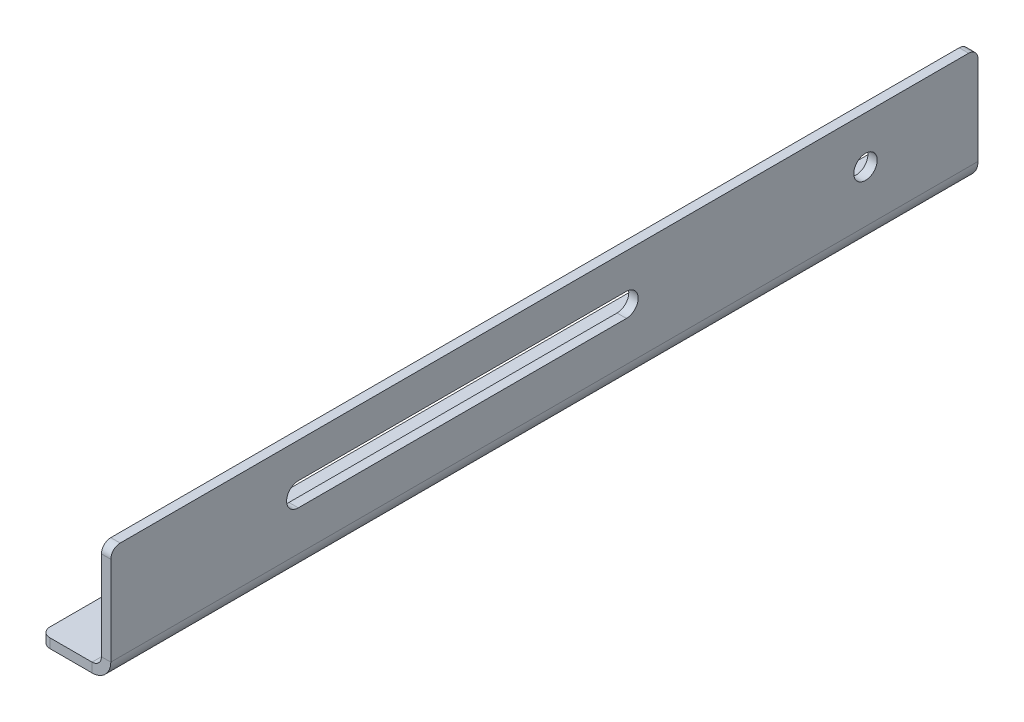
ISO-10303-21;
HEADER;
FILE_DESCRIPTION(('STEP AP214'),'2;1');
FILE_NAME('part.step','',(''),(''),'','','');
FILE_SCHEMA(('AUTOMOTIVE_DESIGN { 1 0 10303 214 1 1 1 1 }'));
ENDSEC;
DATA;
#1=APPLICATION_CONTEXT('core data for automotive mechanical design processes');
#2=APPLICATION_PROTOCOL_DEFINITION('international standard','automotive_design',2000,#1);
#3=PRODUCT_CONTEXT('',#1,'mechanical');
#4=PRODUCT('Part','Part','',(#3));
#5=PRODUCT_RELATED_PRODUCT_CATEGORY('part','',(#4));
#6=PRODUCT_DEFINITION_FORMATION('','',#4);
#7=PRODUCT_DEFINITION_CONTEXT('part definition',#1,'design');
#8=PRODUCT_DEFINITION('design','',#6,#7);
#9=PRODUCT_DEFINITION_SHAPE('','',#8);
#10=(LENGTH_UNIT() NAMED_UNIT(*) SI_UNIT(.MILLI.,.METRE.));
#11=(NAMED_UNIT(*) PLANE_ANGLE_UNIT() SI_UNIT($,.RADIAN.));
#12=(NAMED_UNIT(*) SI_UNIT($,.STERADIAN.) SOLID_ANGLE_UNIT());
#13=UNCERTAINTY_MEASURE_WITH_UNIT(LENGTH_MEASURE(1.E-05),#10,'distance_accuracy_value','');
#14=(GEOMETRIC_REPRESENTATION_CONTEXT(3) GLOBAL_UNCERTAINTY_ASSIGNED_CONTEXT((#13)) GLOBAL_UNIT_ASSIGNED_CONTEXT((#10,
#11,#12)) REPRESENTATION_CONTEXT('',''));
#15=CARTESIAN_POINT('',(0.,0.,0.));
#16=DIRECTION('',(0.,0.,1.));
#17=DIRECTION('',(1.,0.,0.));
#18=AXIS2_PLACEMENT_3D('',#15,#16,#17);
#19=CARTESIAN_POINT('',(0.,4.,0.));
#20=DIRECTION('',(0.,0.,1.));
#21=DIRECTION('',(-1.,0.,0.));
#22=AXIS2_PLACEMENT_3D('',#19,#20,#21);
#23=PLANE('',#22);
#24=DIRECTION('',(1.,0.,0.));
#25=VECTOR('',#24,1.);
#26=CARTESIAN_POINT('',(0.,0.,0.));
#27=LINE('',#26,#25);
#28=CARTESIAN_POINT('',(22.,0.,0.));
#29=VERTEX_POINT('',#28);
#30=CARTESIAN_POINT('',(4.,0.,0.));
#31=VERTEX_POINT('',#30);
#32=EDGE_CURVE('E271',#29,#31,#27,.F.);
#33=ORIENTED_EDGE('',*,*,#32,.T.);
#34=DIRECTION('',(0.,1.,0.));
#35=VECTOR('',#34,1.);
#36=CARTESIAN_POINT('',(4.,4.,0.));
#37=LINE('',#36,#35);
#38=CARTESIAN_POINT('',(4.,4.,0.));
#39=VERTEX_POINT('',#38);
#40=EDGE_CURVE('E303',#31,#39,#37,.T.);
#41=ORIENTED_EDGE('',*,*,#40,.T.);
#42=DIRECTION('',(-1.,0.,0.));
#43=VECTOR('',#42,1.);
#44=CARTESIAN_POINT('',(0.,4.,0.));
#45=LINE('',#44,#43);
#46=CARTESIAN_POINT('',(22.,4.,0.));
#47=VERTEX_POINT('',#46);
#48=EDGE_CURVE('E390',#47,#39,#45,.T.);
#49=ORIENTED_EDGE('',*,*,#48,.F.);
#50=DIRECTION('',(0.,1.,0.));
#51=VECTOR('',#50,1.);
#52=CARTESIAN_POINT('',(22.,4.,0.));
#53=LINE('',#52,#51);
#54=EDGE_CURVE('E300',#29,#47,#53,.T.);
#55=ORIENTED_EDGE('',*,*,#54,.F.);
#56=EDGE_LOOP('',(#33,#41,#49,#55));
#57=FACE_BOUND('',#56,.T.);
#58=ADVANCED_FACE('F42',(#57),#23,.F.);
#59=CARTESIAN_POINT('',(0.,4.,370.));
#60=DIRECTION('',(-1.,0.,0.));
#61=DIRECTION('',(0.,0.,-1.));
#62=AXIS2_PLACEMENT_3D('',#59,#60,#61);
#63=PLANE('',#62);
#64=DIRECTION('',(0.,0.,-1.));
#65=VECTOR('',#64,1.);
#66=CARTESIAN_POINT('',(0.,4.,370.));
#67=LINE('',#66,#65);
#68=CARTESIAN_POINT('',(0.,4.,366.));
#69=VERTEX_POINT('',#68);
#70=CARTESIAN_POINT('',(0.,4.,4.));
#71=VERTEX_POINT('',#70);
#72=EDGE_CURVE('E404',#69,#71,#67,.T.);
#73=ORIENTED_EDGE('',*,*,#72,.T.);
#74=DIRECTION('',(0.,-1.,0.));
#75=VECTOR('',#74,1.);
#76=CARTESIAN_POINT('',(0.,4.,4.));
#77=LINE('',#76,#75);
#78=CARTESIAN_POINT('',(0.,0.,4.));
#79=VERTEX_POINT('',#78);
#80=EDGE_CURVE('E320',#71,#79,#77,.T.);
#81=ORIENTED_EDGE('',*,*,#80,.T.);
#82=DIRECTION('',(0.,0.,-1.));
#83=VECTOR('',#82,1.);
#84=CARTESIAN_POINT('',(0.,0.,370.));
#85=LINE('',#84,#83);
#86=CARTESIAN_POINT('',(0.,0.,366.));
#87=VERTEX_POINT('',#86);
#88=EDGE_CURVE('E267',#87,#79,#85,.T.);
#89=ORIENTED_EDGE('',*,*,#88,.F.);
#90=DIRECTION('',(0.,1.,0.));
#91=VECTOR('',#90,1.);
#92=CARTESIAN_POINT('',(0.,4.,366.));
#93=LINE('',#92,#91);
#94=EDGE_CURVE('E316',#87,#69,#93,.T.);
#95=ORIENTED_EDGE('',*,*,#94,.T.);
#96=EDGE_LOOP('',(#73,#81,#89,#95));
#97=FACE_BOUND('',#96,.T.);
#98=ADVANCED_FACE('F450',(#97),#63,.T.);
#99=CARTESIAN_POINT('',(0.,4.,370.));
#100=DIRECTION('',(0.,0.,1.));
#101=DIRECTION('',(-1.,0.,0.));
#102=AXIS2_PLACEMENT_3D('',#99,#100,#101);
#103=PLANE('',#102);
#104=DIRECTION('',(-1.,0.,0.));
#105=VECTOR('',#104,1.);
#106=CARTESIAN_POINT('',(0.,4.,370.));
#107=LINE('',#106,#105);
#108=CARTESIAN_POINT('',(22.,4.,370.));
#109=VERTEX_POINT('',#108);
#110=CARTESIAN_POINT('',(4.,4.,370.));
#111=VERTEX_POINT('',#110);
#112=EDGE_CURVE('E410',#109,#111,#107,.T.);
#113=ORIENTED_EDGE('',*,*,#112,.T.);
#114=DIRECTION('',(0.,1.,0.));
#115=VECTOR('',#114,1.);
#116=CARTESIAN_POINT('',(4.,4.,370.));
#117=LINE('',#116,#115);
#118=CARTESIAN_POINT('',(4.,0.,370.));
#119=VERTEX_POINT('',#118);
#120=EDGE_CURVE('E11',#111,#119,#117,.F.);
#121=ORIENTED_EDGE('',*,*,#120,.T.);
#122=DIRECTION('',(1.,0.,0.));
#123=VECTOR('',#122,1.);
#124=CARTESIAN_POINT('',(0.,0.,370.));
#125=LINE('',#124,#123);
#126=CARTESIAN_POINT('',(22.,0.,370.));
#127=VERTEX_POINT('',#126);
#128=EDGE_CURVE('E235',#127,#119,#125,.F.);
#129=ORIENTED_EDGE('',*,*,#128,.F.);
#130=DIRECTION('',(0.,1.,0.));
#131=VECTOR('',#130,1.);
#132=CARTESIAN_POINT('',(22.,4.,370.));
#133=LINE('',#132,#131);
#134=EDGE_CURVE('E297',#127,#109,#133,.T.);
#135=ORIENTED_EDGE('',*,*,#134,.T.);
#136=EDGE_LOOP('',(#113,#121,#129,#135));
#137=FACE_BOUND('',#136,.T.);
#138=ADVANCED_FACE('F455',(#137),#103,.T.);
#139=CARTESIAN_POINT('',(22.,8.,370.));
#140=DIRECTION('',(0.,0.,1.));
#141=DIRECTION('',(1.,0.,0.));
#142=AXIS2_PLACEMENT_3D('',#139,#140,#141);
#143=PLANE('',#142);
#144=ORIENTED_EDGE('',*,*,#134,.F.);
#145=CARTESIAN_POINT('',(22.,8.,370.));
#146=DIRECTION('',(0.,0.,1.));
#147=DIRECTION('',(1.,0.,0.));
#148=AXIS2_PLACEMENT_3D('',#145,#146,#147);
#149=CIRCLE('',#148,8.);
#150=CARTESIAN_POINT('',(30.,8.,370.));
#151=VERTEX_POINT('',#150);
#152=EDGE_CURVE('E258',#127,#151,#149,.T.);
#153=ORIENTED_EDGE('',*,*,#152,.T.);
#154=DIRECTION('',(-1.,0.,0.));
#155=VECTOR('',#154,1.);
#156=CARTESIAN_POINT('',(26.,8.,370.));
#157=LINE('',#156,#155);
#158=CARTESIAN_POINT('',(26.,8.,370.));
#159=VERTEX_POINT('',#158);
#160=EDGE_CURVE('E293',#151,#159,#157,.T.);
#161=ORIENTED_EDGE('',*,*,#160,.T.);
#162=CARTESIAN_POINT('',(22.,8.,370.));
#163=DIRECTION('',(0.,0.,-1.));
#164=DIRECTION('',(-1.,0.,0.));
#165=AXIS2_PLACEMENT_3D('',#162,#163,#164);
#166=CIRCLE('',#165,4.);
#167=EDGE_CURVE('E217',#109,#159,#166,.F.);
#168=ORIENTED_EDGE('',*,*,#167,.F.);
#169=EDGE_LOOP('',(#144,#153,#161,#168));
#170=FACE_BOUND('',#169,.T.);
#171=ADVANCED_FACE('F366',(#170),#143,.T.);
#172=CARTESIAN_POINT('',(26.,4.,370.));
#173=DIRECTION('',(0.,0.,1.));
#174=DIRECTION('',(0.,-1.,0.));
#175=AXIS2_PLACEMENT_3D('',#172,#173,#174);
#176=PLANE('',#175);
#177=DIRECTION('',(0.,1.,0.));
#178=VECTOR('',#177,1.);
#179=CARTESIAN_POINT('',(30.,4.,370.));
#180=LINE('',#179,#178);
#181=CARTESIAN_POINT('',(30.,46.,370.));
#182=VERTEX_POINT('',#181);
#183=EDGE_CURVE('E252',#182,#151,#180,.F.);
#184=ORIENTED_EDGE('',*,*,#183,.F.);
#185=DIRECTION('',(1.,0.,0.));
#186=VECTOR('',#185,1.);
#187=CARTESIAN_POINT('',(26.,46.,370.));
#188=LINE('',#187,#186);
#189=CARTESIAN_POINT('',(26.,46.,370.));
#190=VERTEX_POINT('',#189);
#191=EDGE_CURVE('E51',#182,#190,#188,.F.);
#192=ORIENTED_EDGE('',*,*,#191,.T.);
#193=DIRECTION('',(0.,-1.,0.));
#194=VECTOR('',#193,1.);
#195=CARTESIAN_POINT('',(26.,4.,370.));
#196=LINE('',#195,#194);
#197=EDGE_CURVE('E199',#190,#159,#196,.T.);
#198=ORIENTED_EDGE('',*,*,#197,.T.);
#199=ORIENTED_EDGE('',*,*,#160,.F.);
#200=EDGE_LOOP('',(#184,#192,#198,#199));
#201=FACE_BOUND('',#200,.T.);
#202=ADVANCED_FACE('F354',(#201),#176,.T.);
#203=CARTESIAN_POINT('',(26.,50.,370.));
#204=DIRECTION('',(0.,-1.,0.));
#205=DIRECTION('',(0.,0.,-1.));
#206=AXIS2_PLACEMENT_3D('',#203,#204,#205);
#207=PLANE('',#206);
#208=DIRECTION('',(0.,0.,-1.));
#209=VECTOR('',#208,1.);
#210=CARTESIAN_POINT('',(30.,50.,370.));
#211=LINE('',#210,#209);
#212=CARTESIAN_POINT('',(30.,50.,366.));
#213=VERTEX_POINT('',#212);
#214=CARTESIAN_POINT('',(30.,50.,4.));
#215=VERTEX_POINT('',#214);
#216=EDGE_CURVE('E230',#213,#215,#211,.T.);
#217=ORIENTED_EDGE('',*,*,#216,.T.);
#218=DIRECTION('',(1.,0.,0.));
#219=VECTOR('',#218,1.);
#220=CARTESIAN_POINT('',(26.,50.,4.));
#221=LINE('',#220,#219);
#222=CARTESIAN_POINT('',(26.,50.,4.));
#223=VERTEX_POINT('',#222);
#224=EDGE_CURVE('E332',#215,#223,#221,.F.);
#225=ORIENTED_EDGE('',*,*,#224,.T.);
#226=DIRECTION('',(0.,0.,-1.));
#227=VECTOR('',#226,1.);
#228=CARTESIAN_POINT('',(26.,50.,370.));
#229=LINE('',#228,#227);
#230=CARTESIAN_POINT('',(26.,50.,366.));
#231=VERTEX_POINT('',#230);
#232=EDGE_CURVE('E202',#231,#223,#229,.T.);
#233=ORIENTED_EDGE('',*,*,#232,.F.);
#234=DIRECTION('',(-1.,0.,0.));
#235=VECTOR('',#234,1.);
#236=CARTESIAN_POINT('',(26.,50.,366.));
#237=LINE('',#236,#235);
#238=EDGE_CURVE('E329',#231,#213,#237,.F.);
#239=ORIENTED_EDGE('',*,*,#238,.T.);
#240=EDGE_LOOP('',(#217,#225,#233,#239));
#241=FACE_BOUND('',#240,.T.);
#242=ADVANCED_FACE('F381',(#241),#207,.F.);
#243=CARTESIAN_POINT('',(26.,4.,0.));
#244=DIRECTION('',(0.,0.,1.));
#245=DIRECTION('',(0.,-1.,0.));
#246=AXIS2_PLACEMENT_3D('',#243,#244,#245);
#247=PLANE('',#246);
#248=DIRECTION('',(0.,-1.,0.));
#249=VECTOR('',#248,1.);
#250=CARTESIAN_POINT('',(26.,4.,0.));
#251=LINE('',#250,#249);
#252=CARTESIAN_POINT('',(26.,46.,0.));
#253=VERTEX_POINT('',#252);
#254=CARTESIAN_POINT('',(26.,8.,0.));
#255=VERTEX_POINT('',#254);
#256=EDGE_CURVE('E196',#253,#255,#251,.T.);
#257=ORIENTED_EDGE('',*,*,#256,.F.);
#258=DIRECTION('',(1.,0.,0.));
#259=VECTOR('',#258,1.);
#260=CARTESIAN_POINT('',(26.,46.,0.));
#261=LINE('',#260,#259);
#262=CARTESIAN_POINT('',(30.,46.,0.));
#263=VERTEX_POINT('',#262);
#264=EDGE_CURVE('E66',#253,#263,#261,.T.);
#265=ORIENTED_EDGE('',*,*,#264,.T.);
#266=DIRECTION('',(0.,1.,0.));
#267=VECTOR('',#266,1.);
#268=CARTESIAN_POINT('',(30.,4.,0.));
#269=LINE('',#268,#267);
#270=CARTESIAN_POINT('',(30.,8.,0.));
#271=VERTEX_POINT('',#270);
#272=EDGE_CURVE('E243',#263,#271,#269,.F.);
#273=ORIENTED_EDGE('',*,*,#272,.T.);
#274=DIRECTION('',(-1.,0.,0.));
#275=VECTOR('',#274,1.);
#276=CARTESIAN_POINT('',(26.,8.,0.));
#277=LINE('',#276,#275);
#278=EDGE_CURVE('E291',#271,#255,#277,.T.);
#279=ORIENTED_EDGE('',*,*,#278,.T.);
#280=EDGE_LOOP('',(#257,#265,#273,#279));
#281=FACE_BOUND('',#280,.T.);
#282=ADVANCED_FACE('F383',(#281),#247,.F.);
#283=CARTESIAN_POINT('',(26.,35.,150.));
#284=DIRECTION('',(0.,-1.,0.));
#285=DIRECTION('',(0.,0.,-1.));
#286=AXIS2_PLACEMENT_3D('',#283,#284,#285);
#287=PLANE('',#286);
#288=DIRECTION('',(-1.,0.,0.));
#289=VECTOR('',#288,1.);
#290=CARTESIAN_POINT('',(26.,35.,150.));
#291=LINE('',#290,#289);
#292=CARTESIAN_POINT('',(30.,35.,150.));
#293=VERTEX_POINT('',#292);
#294=CARTESIAN_POINT('',(26.,35.,150.));
#295=VERTEX_POINT('',#294);
#296=EDGE_CURVE('E185',#293,#295,#291,.T.);
#297=ORIENTED_EDGE('',*,*,#296,.F.);
#298=DIRECTION('',(0.,0.,-1.));
#299=VECTOR('',#298,1.);
#300=CARTESIAN_POINT('',(30.,35.,370.));
#301=LINE('',#300,#299);
#302=CARTESIAN_POINT('',(30.,35.,290.));
#303=VERTEX_POINT('',#302);
#304=EDGE_CURVE('E244',#303,#293,#301,.T.);
#305=ORIENTED_EDGE('',*,*,#304,.F.);
#306=DIRECTION('',(-1.,0.,0.));
#307=VECTOR('',#306,1.);
#308=CARTESIAN_POINT('',(26.,35.,290.));
#309=LINE('',#308,#307);
#310=CARTESIAN_POINT('',(26.,35.,290.));
#311=VERTEX_POINT('',#310);
#312=EDGE_CURVE('E287',#303,#311,#309,.T.);
#313=ORIENTED_EDGE('',*,*,#312,.T.);
#314=DIRECTION('',(0.,0.,-1.));
#315=VECTOR('',#314,1.);
#316=CARTESIAN_POINT('',(26.,35.,150.));
#317=LINE('',#316,#315);
#318=EDGE_CURVE('E187',#311,#295,#317,.T.);
#319=ORIENTED_EDGE('',*,*,#318,.T.);
#320=EDGE_LOOP('',(#297,#305,#313,#319));
#321=FACE_BOUND('',#320,.T.);
#322=ADVANCED_FACE('F439',(#321),#287,.T.);
#323=CARTESIAN_POINT('',(26.,30.,290.));
#324=DIRECTION('',(1.,0.,0.));
#325=DIRECTION('',(0.,0.,-1.));
#326=AXIS2_PLACEMENT_3D('',#323,#324,#325);
#327=CYLINDRICAL_SURFACE('',#326,5.);
#328=ORIENTED_EDGE('',*,*,#312,.F.);
#329=CARTESIAN_POINT('',(30.,30.,290.));
#330=DIRECTION('',(-1.,0.,0.));
#331=DIRECTION('',(0.,-1.,0.));
#332=AXIS2_PLACEMENT_3D('',#329,#330,#331);
#333=CIRCLE('',#332,5.);
#334=CARTESIAN_POINT('',(30.,25.,290.));
#335=VERTEX_POINT('',#334);
#336=EDGE_CURVE('E239',#335,#303,#333,.T.);
#337=ORIENTED_EDGE('',*,*,#336,.F.);
#338=DIRECTION('',(-1.,0.,0.));
#339=VECTOR('',#338,1.);
#340=CARTESIAN_POINT('',(26.,25.,290.));
#341=LINE('',#340,#339);
#342=CARTESIAN_POINT('',(26.,25.,290.));
#343=VERTEX_POINT('',#342);
#344=EDGE_CURVE('E169',#335,#343,#341,.T.);
#345=ORIENTED_EDGE('',*,*,#344,.T.);
#346=CARTESIAN_POINT('',(26.,30.,290.));
#347=DIRECTION('',(-1.,0.,0.));
#348=DIRECTION('',(0.,-1.,0.));
#349=AXIS2_PLACEMENT_3D('',#346,#347,#348);
#350=CIRCLE('',#349,5.);
#351=EDGE_CURVE('E180',#343,#311,#350,.T.);
#352=ORIENTED_EDGE('',*,*,#351,.T.);
#353=EDGE_LOOP('',(#328,#337,#345,#352));
#354=FACE_BOUND('',#353,.T.);
#355=ADVANCED_FACE('F436',(#354),#327,.F.);
#356=CARTESIAN_POINT('',(26.,25.,150.));
#357=DIRECTION('',(0.,1.,0.));
#358=DIRECTION('',(0.,0.,1.));
#359=AXIS2_PLACEMENT_3D('',#356,#357,#358);
#360=PLANE('',#359);
#361=ORIENTED_EDGE('',*,*,#344,.F.);
#362=DIRECTION('',(0.,0.,-1.));
#363=VECTOR('',#362,1.);
#364=CARTESIAN_POINT('',(30.,25.,370.));
#365=LINE('',#364,#363);
#366=CARTESIAN_POINT('',(30.,25.,150.));
#367=VERTEX_POINT('',#366);
#368=EDGE_CURVE('E163',#367,#335,#365,.F.);
#369=ORIENTED_EDGE('',*,*,#368,.F.);
#370=DIRECTION('',(-1.,0.,0.));
#371=VECTOR('',#370,1.);
#372=CARTESIAN_POINT('',(26.,25.,150.));
#373=LINE('',#372,#371);
#374=CARTESIAN_POINT('',(26.,25.,150.));
#375=VERTEX_POINT('',#374);
#376=EDGE_CURVE('E157',#367,#375,#373,.T.);
#377=ORIENTED_EDGE('',*,*,#376,.T.);
#378=DIRECTION('',(0.,0.,1.));
#379=VECTOR('',#378,1.);
#380=CARTESIAN_POINT('',(26.,25.,150.));
#381=LINE('',#380,#379);
#382=EDGE_CURVE('E160',#375,#343,#381,.T.);
#383=ORIENTED_EDGE('',*,*,#382,.T.);
#384=EDGE_LOOP('',(#361,#369,#377,#383));
#385=FACE_BOUND('',#384,.T.);
#386=ADVANCED_FACE('F159',(#385),#360,.T.);
#387=CARTESIAN_POINT('',(8.2,4.,342.3));
#388=DIRECTION('',(0.,-1.,0.));
#389=DIRECTION('',(0.,0.,-1.));
#390=AXIS2_PLACEMENT_3D('',#387,#388,#389);
#391=CYLINDRICAL_SURFACE('',#390,2.5);
#392=CARTESIAN_POINT('',(8.2,4.,342.3));
#393=DIRECTION('',(0.,-1.,0.));
#394=DIRECTION('',(0.,0.,-1.));
#395=AXIS2_PLACEMENT_3D('',#392,#393,#394);
#396=CIRCLE('',#395,2.5);
#397=CARTESIAN_POINT('',(8.2,4.,339.8));
#398=VERTEX_POINT('',#397);
#399=EDGE_CURVE('E222',#398,#398,#396,.T.);
#400=ORIENTED_EDGE('',*,*,#399,.F.);
#401=EDGE_LOOP('',(#400));
#402=FACE_BOUND('',#401,.T.);
#403=CARTESIAN_POINT('',(8.2,0.,342.3));
#404=DIRECTION('',(0.,-1.,0.));
#405=DIRECTION('',(0.,0.,-1.));
#406=AXIS2_PLACEMENT_3D('',#403,#404,#405);
#407=CIRCLE('',#406,2.5);
#408=CARTESIAN_POINT('',(8.2,0.,339.8));
#409=VERTEX_POINT('',#408);
#410=EDGE_CURVE('E262',#409,#409,#407,.T.);
#411=ORIENTED_EDGE('',*,*,#410,.T.);
#412=EDGE_LOOP('',(#411));
#413=FACE_BOUND('',#412,.T.);
#414=ADVANCED_FACE('F462',(#402,#413),#391,.F.);
#415=CARTESIAN_POINT('',(8.2,4.,27.7));
#416=DIRECTION('',(0.,-1.,0.));
#417=DIRECTION('',(0.,0.,-1.));
#418=AXIS2_PLACEMENT_3D('',#415,#416,#417);
#419=CYLINDRICAL_SURFACE('',#418,2.5);
#420=CARTESIAN_POINT('',(8.2,4.,27.7));
#421=DIRECTION('',(0.,-1.,0.));
#422=DIRECTION('',(0.,0.,-1.));
#423=AXIS2_PLACEMENT_3D('',#420,#421,#422);
#424=CIRCLE('',#423,2.5);
#425=CARTESIAN_POINT('',(8.2,4.,25.2));
#426=VERTEX_POINT('',#425);
#427=EDGE_CURVE('E405',#426,#426,#424,.T.);
#428=ORIENTED_EDGE('',*,*,#427,.F.);
#429=EDGE_LOOP('',(#428));
#430=FACE_BOUND('',#429,.T.);
#431=CARTESIAN_POINT('',(8.2,0.,27.7));
#432=DIRECTION('',(0.,-1.,0.));
#433=DIRECTION('',(0.,0.,-1.));
#434=AXIS2_PLACEMENT_3D('',#431,#432,#433);
#435=CIRCLE('',#434,2.5);
#436=CARTESIAN_POINT('',(8.2,0.,25.2));
#437=VERTEX_POINT('',#436);
#438=EDGE_CURVE('E275',#437,#437,#435,.T.);
#439=ORIENTED_EDGE('',*,*,#438,.T.);
#440=EDGE_LOOP('',(#439));
#441=FACE_BOUND('',#440,.T.);
#442=ADVANCED_FACE('F427',(#430,#441),#419,.F.);
#443=CARTESIAN_POINT('',(26.,30.,48.));
#444=DIRECTION('',(1.,0.,0.));
#445=DIRECTION('',(0.,0.,-1.));
#446=AXIS2_PLACEMENT_3D('',#443,#444,#445);
#447=CYLINDRICAL_SURFACE('',#446,4.99999999999999);
#448=CARTESIAN_POINT('',(26.,30.,48.));
#449=DIRECTION('',(1.,0.,0.));
#450=DIRECTION('',(0.,0.,-1.));
#451=AXIS2_PLACEMENT_3D('',#448,#449,#450);
#452=CIRCLE('',#451,4.99999999999999);
#453=CARTESIAN_POINT('',(26.,30.,43.));
#454=VERTEX_POINT('',#453);
#455=EDGE_CURVE('E182',#454,#454,#452,.T.);
#456=ORIENTED_EDGE('',*,*,#455,.F.);
#457=EDGE_LOOP('',(#456));
#458=FACE_BOUND('',#457,.T.);
#459=CARTESIAN_POINT('',(30.,30.,48.));
#460=DIRECTION('',(1.,0.,0.));
#461=DIRECTION('',(0.,0.,-1.));
#462=AXIS2_PLACEMENT_3D('',#459,#460,#461);
#463=CIRCLE('',#462,4.99999999999999);
#464=CARTESIAN_POINT('',(30.,30.,43.));
#465=VERTEX_POINT('',#464);
#466=EDGE_CURVE('E231',#465,#465,#463,.T.);
#467=ORIENTED_EDGE('',*,*,#466,.T.);
#468=EDGE_LOOP('',(#467));
#469=FACE_BOUND('',#468,.T.);
#470=ADVANCED_FACE('F424',(#458,#469),#447,.F.);
#471=CARTESIAN_POINT('',(26.,30.,150.));
#472=DIRECTION('',(1.,0.,0.));
#473=DIRECTION('',(0.,0.,-1.));
#474=AXIS2_PLACEMENT_3D('',#471,#472,#473);
#475=CYLINDRICAL_SURFACE('',#474,5.);
#476=CARTESIAN_POINT('',(30.,30.,150.));
#477=DIRECTION('',(-1.,0.,0.));
#478=DIRECTION('',(0.,-1.,0.));
#479=AXIS2_PLACEMENT_3D('',#476,#477,#478);
#480=CIRCLE('',#479,5.);
#481=EDGE_CURVE('E238',#293,#367,#480,.T.);
#482=ORIENTED_EDGE('',*,*,#481,.F.);
#483=ORIENTED_EDGE('',*,*,#296,.T.);
#484=CARTESIAN_POINT('',(26.,30.,150.));
#485=DIRECTION('',(-1.,0.,0.));
#486=DIRECTION('',(0.,-1.,0.));
#487=AXIS2_PLACEMENT_3D('',#484,#485,#486);
#488=CIRCLE('',#487,5.);
#489=EDGE_CURVE('E177',#295,#375,#488,.T.);
#490=ORIENTED_EDGE('',*,*,#489,.T.);
#491=ORIENTED_EDGE('',*,*,#376,.F.);
#492=EDGE_LOOP('',(#482,#483,#490,#491));
#493=FACE_BOUND('',#492,.T.);
#494=ADVANCED_FACE('F184',(#493),#475,.F.);
#495=CARTESIAN_POINT('',(22.,8.,0.));
#496=DIRECTION('',(0.,0.,-1.));
#497=DIRECTION('',(-1.,0.,0.));
#498=AXIS2_PLACEMENT_3D('',#495,#496,#497);
#499=PLANE('',#498);
#500=CARTESIAN_POINT('',(22.,8.,0.));
#501=DIRECTION('',(0.,0.,1.));
#502=DIRECTION('',(1.,0.,0.));
#503=AXIS2_PLACEMENT_3D('',#500,#501,#502);
#504=CIRCLE('',#503,8.);
#505=EDGE_CURVE('E263',#271,#29,#504,.F.);
#506=ORIENTED_EDGE('',*,*,#505,.T.);
#507=ORIENTED_EDGE('',*,*,#54,.T.);
#508=CARTESIAN_POINT('',(22.,8.,0.));
#509=DIRECTION('',(0.,0.,1.));
#510=DIRECTION('',(1.,0.,0.));
#511=AXIS2_PLACEMENT_3D('',#508,#509,#510);
#512=CIRCLE('',#511,4.);
#513=EDGE_CURVE('E213',#255,#47,#512,.F.);
#514=ORIENTED_EDGE('',*,*,#513,.F.);
#515=ORIENTED_EDGE('',*,*,#278,.F.);
#516=EDGE_LOOP('',(#506,#507,#514,#515));
#517=FACE_BOUND('',#516,.T.);
#518=ADVANCED_FACE('F385',(#517),#499,.T.);
#519=CARTESIAN_POINT('',(26.,4.,370.));
#520=DIRECTION('',(1.,0.,0.));
#521=DIRECTION('',(0.,0.,-1.));
#522=AXIS2_PLACEMENT_3D('',#519,#520,#521);
#523=PLANE('',#522);
#524=ORIENTED_EDGE('',*,*,#455,.T.);
#525=EDGE_LOOP('',(#524));
#526=FACE_BOUND('',#525,.T.);
#527=ORIENTED_EDGE('',*,*,#382,.F.);
#528=ORIENTED_EDGE('',*,*,#489,.F.);
#529=ORIENTED_EDGE('',*,*,#318,.F.);
#530=ORIENTED_EDGE('',*,*,#351,.F.);
#531=EDGE_LOOP('',(#527,#528,#529,#530));
#532=FACE_BOUND('',#531,.T.);
#533=ORIENTED_EDGE('',*,*,#232,.T.);
#534=CARTESIAN_POINT('',(26.,46.,4.));
#535=DIRECTION('',(1.,0.,0.));
#536=DIRECTION('',(0.,0.,-1.));
#537=AXIS2_PLACEMENT_3D('',#534,#535,#536);
#538=CIRCLE('',#537,4.);
#539=EDGE_CURVE('E339',#223,#253,#538,.F.);
#540=ORIENTED_EDGE('',*,*,#539,.T.);
#541=ORIENTED_EDGE('',*,*,#256,.T.);
#542=DIRECTION('',(0.,0.,-1.));
#543=VECTOR('',#542,1.);
#544=CARTESIAN_POINT('',(26.,8.,370.));
#545=LINE('',#544,#543);
#546=EDGE_CURVE('E170',#255,#159,#545,.F.);
#547=ORIENTED_EDGE('',*,*,#546,.T.);
#548=ORIENTED_EDGE('',*,*,#197,.F.);
#549=CARTESIAN_POINT('',(26.,46.,366.));
#550=DIRECTION('',(1.,0.,0.));
#551=DIRECTION('',(0.,0.,-1.));
#552=AXIS2_PLACEMENT_3D('',#549,#550,#551);
#553=CIRCLE('',#552,4.);
#554=EDGE_CURVE('E336',#190,#231,#553,.F.);
#555=ORIENTED_EDGE('',*,*,#554,.T.);
#556=EDGE_LOOP('',(#533,#540,#541,#547,#548,#555));
#557=FACE_BOUND('',#556,.T.);
#558=ADVANCED_FACE('F174',(#526,#532,#557),#523,.F.);
#559=CARTESIAN_POINT('',(0.,4.,370.));
#560=DIRECTION('',(0.,-1.,0.));
#561=DIRECTION('',(0.,0.,-1.));
#562=AXIS2_PLACEMENT_3D('',#559,#560,#561);
#563=PLANE('',#562);
#564=ORIENTED_EDGE('',*,*,#399,.T.);
#565=EDGE_LOOP('',(#564));
#566=FACE_BOUND('',#565,.T.);
#567=ORIENTED_EDGE('',*,*,#427,.T.);
#568=EDGE_LOOP('',(#567));
#569=FACE_BOUND('',#568,.T.);
#570=ORIENTED_EDGE('',*,*,#48,.T.);
#571=CARTESIAN_POINT('',(4.,4.,4.));
#572=DIRECTION('',(0.,-1.,0.));
#573=DIRECTION('',(0.,0.,-1.));
#574=AXIS2_PLACEMENT_3D('',#571,#572,#573);
#575=CIRCLE('',#574,4.);
#576=EDGE_CURVE('E313',#39,#71,#575,.F.);
#577=ORIENTED_EDGE('',*,*,#576,.T.);
#578=ORIENTED_EDGE('',*,*,#72,.F.);
#579=CARTESIAN_POINT('',(4.,4.,366.));
#580=DIRECTION('',(0.,-1.,0.));
#581=DIRECTION('',(0.,0.,-1.));
#582=AXIS2_PLACEMENT_3D('',#579,#580,#581);
#583=CIRCLE('',#582,4.);
#584=EDGE_CURVE('E310',#69,#111,#583,.F.);
#585=ORIENTED_EDGE('',*,*,#584,.T.);
#586=ORIENTED_EDGE('',*,*,#112,.F.);
#587=DIRECTION('',(0.,0.,-1.));
#588=VECTOR('',#587,1.);
#589=CARTESIAN_POINT('',(22.,4.,0.));
#590=LINE('',#589,#588);
#591=EDGE_CURVE('E206',#109,#47,#590,.T.);
#592=ORIENTED_EDGE('',*,*,#591,.T.);
#593=EDGE_LOOP('',(#570,#577,#578,#585,#586,#592));
#594=FACE_BOUND('',#593,.T.);
#595=ADVANCED_FACE('F399',(#566,#569,#594),#563,.F.);
#596=CARTESIAN_POINT('',(22.,8.,370.));
#597=DIRECTION('',(0.,0.,1.));
#598=DIRECTION('',(1.,0.,0.));
#599=AXIS2_PLACEMENT_3D('',#596,#597,#598);
#600=CYLINDRICAL_SURFACE('',#599,4.);
#601=ORIENTED_EDGE('',*,*,#167,.T.);
#602=ORIENTED_EDGE('',*,*,#546,.F.);
#603=ORIENTED_EDGE('',*,*,#513,.T.);
#604=ORIENTED_EDGE('',*,*,#591,.F.);
#605=EDGE_LOOP('',(#601,#602,#603,#604));
#606=FACE_BOUND('',#605,.T.);
#607=ADVANCED_FACE('F360',(#606),#600,.F.);
#608=CARTESIAN_POINT('',(30.,4.,370.));
#609=DIRECTION('',(1.,0.,0.));
#610=DIRECTION('',(0.,0.,-1.));
#611=AXIS2_PLACEMENT_3D('',#608,#609,#610);
#612=PLANE('',#611);
#613=ORIENTED_EDGE('',*,*,#466,.F.);
#614=EDGE_LOOP('',(#613));
#615=FACE_BOUND('',#614,.T.);
#616=ORIENTED_EDGE('',*,*,#368,.T.);
#617=ORIENTED_EDGE('',*,*,#336,.T.);
#618=ORIENTED_EDGE('',*,*,#304,.T.);
#619=ORIENTED_EDGE('',*,*,#481,.T.);
#620=EDGE_LOOP('',(#616,#617,#618,#619));
#621=FACE_BOUND('',#620,.T.);
#622=ORIENTED_EDGE('',*,*,#272,.F.);
#623=CARTESIAN_POINT('',(30.,46.,4.));
#624=DIRECTION('',(1.,0.,0.));
#625=DIRECTION('',(0.,0.,-1.));
#626=AXIS2_PLACEMENT_3D('',#623,#624,#625);
#627=CIRCLE('',#626,4.);
#628=EDGE_CURVE('E346',#263,#215,#627,.T.);
#629=ORIENTED_EDGE('',*,*,#628,.T.);
#630=ORIENTED_EDGE('',*,*,#216,.F.);
#631=CARTESIAN_POINT('',(30.,46.,366.));
#632=DIRECTION('',(1.,0.,0.));
#633=DIRECTION('',(0.,0.,-1.));
#634=AXIS2_PLACEMENT_3D('',#631,#632,#633);
#635=CIRCLE('',#634,4.);
#636=EDGE_CURVE('E58',#213,#182,#635,.T.);
#637=ORIENTED_EDGE('',*,*,#636,.T.);
#638=ORIENTED_EDGE('',*,*,#183,.T.);
#639=DIRECTION('',(0.,0.,-1.));
#640=VECTOR('',#639,1.);
#641=CARTESIAN_POINT('',(30.,8.,370.));
#642=LINE('',#641,#640);
#643=EDGE_CURVE('E218',#271,#151,#642,.F.);
#644=ORIENTED_EDGE('',*,*,#643,.F.);
#645=EDGE_LOOP('',(#622,#629,#630,#637,#638,#644));
#646=FACE_BOUND('',#645,.T.);
#647=ADVANCED_FACE('F374',(#615,#621,#646),#612,.T.);
#648=CARTESIAN_POINT('',(0.,0.,370.));
#649=DIRECTION('',(0.,-1.,0.));
#650=DIRECTION('',(0.,0.,-1.));
#651=AXIS2_PLACEMENT_3D('',#648,#649,#650);
#652=PLANE('',#651);
#653=ORIENTED_EDGE('',*,*,#410,.F.);
#654=EDGE_LOOP('',(#653));
#655=FACE_BOUND('',#654,.T.);
#656=ORIENTED_EDGE('',*,*,#438,.F.);
#657=EDGE_LOOP('',(#656));
#658=FACE_BOUND('',#657,.T.);
#659=ORIENTED_EDGE('',*,*,#88,.T.);
#660=CARTESIAN_POINT('',(4.,0.,4.));
#661=DIRECTION('',(0.,-1.,0.));
#662=DIRECTION('',(0.,0.,-1.));
#663=AXIS2_PLACEMENT_3D('',#660,#661,#662);
#664=CIRCLE('',#663,4.);
#665=EDGE_CURVE('E326',#79,#31,#664,.T.);
#666=ORIENTED_EDGE('',*,*,#665,.T.);
#667=ORIENTED_EDGE('',*,*,#32,.F.);
#668=DIRECTION('',(0.,0.,-1.));
#669=VECTOR('',#668,1.);
#670=CARTESIAN_POINT('',(22.,0.,370.));
#671=LINE('',#670,#669);
#672=EDGE_CURVE('E226',#127,#29,#671,.T.);
#673=ORIENTED_EDGE('',*,*,#672,.F.);
#674=ORIENTED_EDGE('',*,*,#128,.T.);
#675=CARTESIAN_POINT('',(4.,0.,366.));
#676=DIRECTION('',(0.,-1.,0.));
#677=DIRECTION('',(0.,0.,-1.));
#678=AXIS2_PLACEMENT_3D('',#675,#676,#677);
#679=CIRCLE('',#678,4.);
#680=EDGE_CURVE('E323',#119,#87,#679,.T.);
#681=ORIENTED_EDGE('',*,*,#680,.T.);
#682=EDGE_LOOP('',(#659,#666,#667,#673,#674,#681));
#683=FACE_BOUND('',#682,.T.);
#684=ADVANCED_FACE('F392',(#655,#658,#683),#652,.T.);
#685=CARTESIAN_POINT('',(22.,8.,370.));
#686=DIRECTION('',(0.,0.,1.));
#687=DIRECTION('',(1.,0.,0.));
#688=AXIS2_PLACEMENT_3D('',#685,#686,#687);
#689=CYLINDRICAL_SURFACE('',#688,8.);
#690=ORIENTED_EDGE('',*,*,#152,.F.);
#691=ORIENTED_EDGE('',*,*,#672,.T.);
#692=ORIENTED_EDGE('',*,*,#505,.F.);
#693=ORIENTED_EDGE('',*,*,#643,.T.);
#694=EDGE_LOOP('',(#690,#691,#692,#693));
#695=FACE_BOUND('',#694,.T.);
#696=ADVANCED_FACE('F372',(#695),#689,.T.);
#697=CARTESIAN_POINT('',(4.,4.,4.));
#698=DIRECTION('',(0.,-1.,0.));
#699=DIRECTION('',(0.,0.,-1.));
#700=AXIS2_PLACEMENT_3D('',#697,#698,#699);
#701=CYLINDRICAL_SURFACE('',#700,4.);
#702=ORIENTED_EDGE('',*,*,#665,.F.);
#703=ORIENTED_EDGE('',*,*,#80,.F.);
#704=ORIENTED_EDGE('',*,*,#576,.F.);
#705=ORIENTED_EDGE('',*,*,#40,.F.);
#706=EDGE_LOOP('',(#702,#703,#704,#705));
#707=FACE_BOUND('',#706,.T.);
#708=ADVANCED_FACE('F397',(#707),#701,.T.);
#709=CARTESIAN_POINT('',(26.,46.,4.));
#710=DIRECTION('',(-1.,0.,0.));
#711=DIRECTION('',(0.,0.,1.));
#712=AXIS2_PLACEMENT_3D('',#709,#710,#711);
#713=CYLINDRICAL_SURFACE('',#712,4.);
#714=ORIENTED_EDGE('',*,*,#628,.F.);
#715=ORIENTED_EDGE('',*,*,#264,.F.);
#716=ORIENTED_EDGE('',*,*,#539,.F.);
#717=ORIENTED_EDGE('',*,*,#224,.F.);
#718=EDGE_LOOP('',(#714,#715,#716,#717));
#719=FACE_BOUND('',#718,.T.);
#720=ADVANCED_FACE('F379',(#719),#713,.T.);
#721=CARTESIAN_POINT('',(26.,46.,366.));
#722=DIRECTION('',(1.,0.,0.));
#723=DIRECTION('',(0.,0.,-1.));
#724=AXIS2_PLACEMENT_3D('',#721,#722,#723);
#725=CYLINDRICAL_SURFACE('',#724,4.);
#726=ORIENTED_EDGE('',*,*,#636,.F.);
#727=ORIENTED_EDGE('',*,*,#238,.F.);
#728=ORIENTED_EDGE('',*,*,#554,.F.);
#729=ORIENTED_EDGE('',*,*,#191,.F.);
#730=EDGE_LOOP('',(#726,#727,#728,#729));
#731=FACE_BOUND('',#730,.T.);
#732=ADVANCED_FACE('F472',(#731),#725,.T.);
#733=CARTESIAN_POINT('',(4.,4.,366.));
#734=DIRECTION('',(0.,1.,0.));
#735=DIRECTION('',(0.,0.,1.));
#736=AXIS2_PLACEMENT_3D('',#733,#734,#735);
#737=CYLINDRICAL_SURFACE('',#736,4.);
#738=ORIENTED_EDGE('',*,*,#680,.F.);
#739=ORIENTED_EDGE('',*,*,#120,.F.);
#740=ORIENTED_EDGE('',*,*,#584,.F.);
#741=ORIENTED_EDGE('',*,*,#94,.F.);
#742=EDGE_LOOP('',(#738,#739,#740,#741));
#743=FACE_BOUND('',#742,.T.);
#744=ADVANCED_FACE('F44',(#743),#737,.T.);
#745=CLOSED_SHELL('',(#58,#98,#138,#171,#202,#242,#282,#322,#355,#386,#414,#442,#470,#494,#518,
#558,#595,#607,#647,#684,#696,#708,#720,#732,#744));
#746=MANIFOLD_SOLID_BREP('B2',#745);
#747=ADVANCED_BREP_SHAPE_REPRESENTATION('',(#18,#746),#14);
#748=SHAPE_DEFINITION_REPRESENTATION(#9,#747);
ENDSEC;
END-ISO-10303-21;
